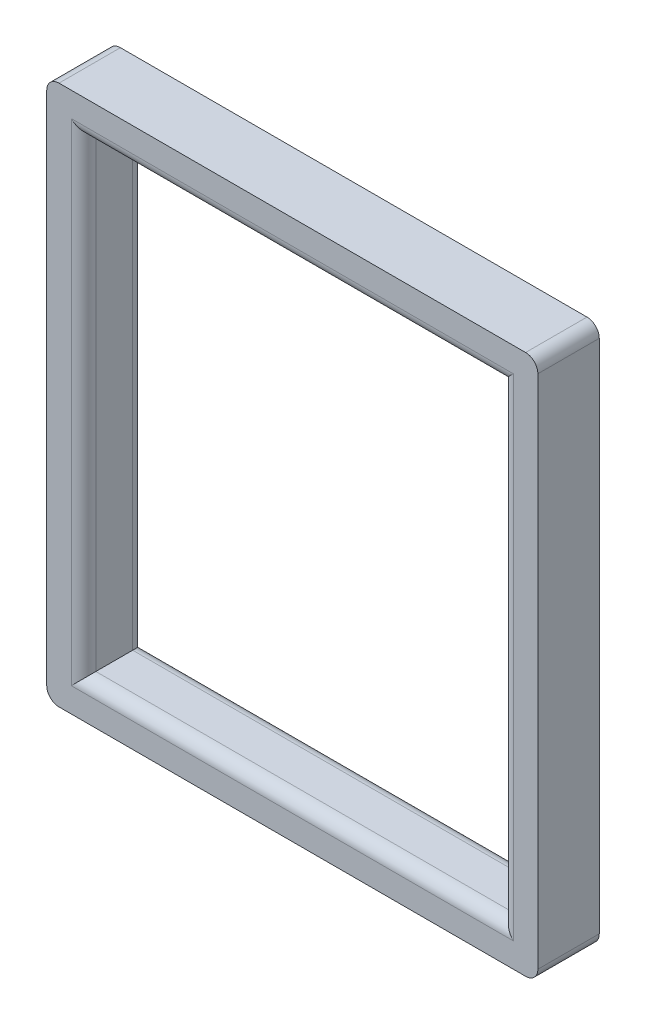
ISO-10303-21;
HEADER;
FILE_DESCRIPTION(('STEP AP214'),'2;1');
FILE_NAME('part.step','',(''),(''),'','','');
FILE_SCHEMA(('AUTOMOTIVE_DESIGN { 1 0 10303 214 1 1 1 1 }'));
ENDSEC;
DATA;
#1=APPLICATION_CONTEXT('core data for automotive mechanical design processes');
#2=APPLICATION_PROTOCOL_DEFINITION('international standard','automotive_design',2000,#1);
#3=PRODUCT_CONTEXT('',#1,'mechanical');
#4=PRODUCT('Part','Part','',(#3));
#5=PRODUCT_RELATED_PRODUCT_CATEGORY('part','',(#4));
#6=PRODUCT_DEFINITION_FORMATION('','',#4);
#7=PRODUCT_DEFINITION_CONTEXT('part definition',#1,'design');
#8=PRODUCT_DEFINITION('design','',#6,#7);
#9=PRODUCT_DEFINITION_SHAPE('','',#8);
#10=(LENGTH_UNIT() NAMED_UNIT(*) SI_UNIT(.MILLI.,.METRE.));
#11=(NAMED_UNIT(*) PLANE_ANGLE_UNIT() SI_UNIT($,.RADIAN.));
#12=(NAMED_UNIT(*) SI_UNIT($,.STERADIAN.) SOLID_ANGLE_UNIT());
#13=UNCERTAINTY_MEASURE_WITH_UNIT(LENGTH_MEASURE(1.E-05),#10,'distance_accuracy_value','');
#14=(GEOMETRIC_REPRESENTATION_CONTEXT(3) GLOBAL_UNCERTAINTY_ASSIGNED_CONTEXT((#13)) GLOBAL_UNIT_ASSIGNED_CONTEXT((#10,
#11,#12)) REPRESENTATION_CONTEXT('',''));
#15=CARTESIAN_POINT('',(0.,0.,0.));
#16=DIRECTION('',(0.,0.,1.));
#17=DIRECTION('',(1.,0.,0.));
#18=AXIS2_PLACEMENT_3D('',#15,#16,#17);
#19=CARTESIAN_POINT('',(0.,0.,3.175));
#20=DIRECTION('',(0.,0.,-1.));
#21=DIRECTION('',(-1.,0.,0.));
#22=AXIS2_PLACEMENT_3D('',#19,#20,#21);
#23=PLANE('',#22);
#24=DIRECTION('',(0.,-1.,0.));
#25=VECTOR('',#24,1.);
#26=CARTESIAN_POINT('',(-11.43,12.065,3.175));
#27=LINE('',#26,#25);
#28=CARTESIAN_POINT('',(-11.43,-12.7,3.175));
#29=VERTEX_POINT('',#28);
#30=CARTESIAN_POINT('',(-11.43,12.7,3.175));
#31=VERTEX_POINT('',#30);
#32=EDGE_CURVE('E202',#29,#31,#27,.F.);
#33=ORIENTED_EDGE('',*,*,#32,.T.);
#34=DIRECTION('',(-1.,0.,0.));
#35=VECTOR('',#34,1.);
#36=CARTESIAN_POINT('',(10.795,12.7,3.175));
#37=LINE('',#36,#35);
#38=CARTESIAN_POINT('',(11.43,12.7,3.175));
#39=VERTEX_POINT('',#38);
#40=EDGE_CURVE('E207',#31,#39,#37,.F.);
#41=ORIENTED_EDGE('',*,*,#40,.T.);
#42=DIRECTION('',(0.,1.,0.));
#43=VECTOR('',#42,1.);
#44=CARTESIAN_POINT('',(11.43,-12.065,3.175));
#45=LINE('',#44,#43);
#46=CARTESIAN_POINT('',(11.43,-12.7,3.175));
#47=VERTEX_POINT('',#46);
#48=EDGE_CURVE('E180',#39,#47,#45,.F.);
#49=ORIENTED_EDGE('',*,*,#48,.T.);
#50=DIRECTION('',(1.,0.,0.));
#51=VECTOR('',#50,1.);
#52=CARTESIAN_POINT('',(-10.795,-12.7,3.175));
#53=LINE('',#52,#51);
#54=EDGE_CURVE('E204',#47,#29,#53,.F.);
#55=ORIENTED_EDGE('',*,*,#54,.T.);
#56=EDGE_LOOP('',(#33,#41,#49,#55));
#57=FACE_BOUND('',#56,.T.);
#58=DIRECTION('',(0.,-1.,0.));
#59=VECTOR('',#58,1.);
#60=CARTESIAN_POINT('',(-12.7,-13.97,3.175));
#61=LINE('',#60,#59);
#62=CARTESIAN_POINT('',(-12.7,13.335,3.175));
#63=VERTEX_POINT('',#62);
#64=CARTESIAN_POINT('',(-12.7,-13.335,3.175));
#65=VERTEX_POINT('',#64);
#66=EDGE_CURVE('E308',#63,#65,#61,.T.);
#67=ORIENTED_EDGE('',*,*,#66,.T.);
#68=CARTESIAN_POINT('',(-12.065,-13.335,3.175));
#69=DIRECTION('',(0.,0.,-1.));
#70=DIRECTION('',(-1.,0.,0.));
#71=AXIS2_PLACEMENT_3D('',#68,#69,#70);
#72=CIRCLE('',#71,0.635);
#73=CARTESIAN_POINT('',(-12.065,-13.97,3.175));
#74=VERTEX_POINT('',#73);
#75=EDGE_CURVE('E200',#65,#74,#72,.F.);
#76=ORIENTED_EDGE('',*,*,#75,.T.);
#77=DIRECTION('',(1.,0.,0.));
#78=VECTOR('',#77,1.);
#79=CARTESIAN_POINT('',(-12.7,-13.97,3.175));
#80=LINE('',#79,#78);
#81=CARTESIAN_POINT('',(12.065,-13.97,3.175));
#82=VERTEX_POINT('',#81);
#83=EDGE_CURVE('E193',#74,#82,#80,.T.);
#84=ORIENTED_EDGE('',*,*,#83,.T.);
#85=CARTESIAN_POINT('',(12.065,-13.335,3.175));
#86=DIRECTION('',(0.,0.,-1.));
#87=DIRECTION('',(-1.,0.,0.));
#88=AXIS2_PLACEMENT_3D('',#85,#86,#87);
#89=CIRCLE('',#88,0.635);
#90=CARTESIAN_POINT('',(12.7,-13.335,3.175));
#91=VERTEX_POINT('',#90);
#92=EDGE_CURVE('E198',#82,#91,#89,.F.);
#93=ORIENTED_EDGE('',*,*,#92,.T.);
#94=DIRECTION('',(0.,1.,0.));
#95=VECTOR('',#94,1.);
#96=CARTESIAN_POINT('',(12.7,-13.97,3.175));
#97=LINE('',#96,#95);
#98=CARTESIAN_POINT('',(12.7,13.335,3.175));
#99=VERTEX_POINT('',#98);
#100=EDGE_CURVE('E294',#91,#99,#97,.T.);
#101=ORIENTED_EDGE('',*,*,#100,.T.);
#102=CARTESIAN_POINT('',(12.065,13.335,3.175));
#103=DIRECTION('',(0.,0.,-1.));
#104=DIRECTION('',(-1.,0.,0.));
#105=AXIS2_PLACEMENT_3D('',#102,#103,#104);
#106=CIRCLE('',#105,0.635);
#107=CARTESIAN_POINT('',(12.065,13.97,3.175));
#108=VERTEX_POINT('',#107);
#109=EDGE_CURVE('E191',#99,#108,#106,.F.);
#110=ORIENTED_EDGE('',*,*,#109,.T.);
#111=DIRECTION('',(-1.,0.,0.));
#112=VECTOR('',#111,1.);
#113=CARTESIAN_POINT('',(-12.7,13.97,3.175));
#114=LINE('',#113,#112);
#115=CARTESIAN_POINT('',(-12.065,13.97,3.175));
#116=VERTEX_POINT('',#115);
#117=EDGE_CURVE('E297',#108,#116,#114,.T.);
#118=ORIENTED_EDGE('',*,*,#117,.T.);
#119=CARTESIAN_POINT('',(-12.065,13.335,3.175));
#120=DIRECTION('',(0.,0.,-1.));
#121=DIRECTION('',(-1.,0.,0.));
#122=AXIS2_PLACEMENT_3D('',#119,#120,#121);
#123=CIRCLE('',#122,0.635);
#124=EDGE_CURVE('E189',#116,#63,#123,.F.);
#125=ORIENTED_EDGE('',*,*,#124,.T.);
#126=EDGE_LOOP('',(#67,#76,#84,#93,#101,#110,#118,#125));
#127=FACE_BOUND('',#126,.T.);
#128=ADVANCED_FACE('F35',(#57,#127),#23,.F.);
#129=CARTESIAN_POINT('',(0.,0.,0.));
#130=DIRECTION('',(0.,0.,-1.));
#131=DIRECTION('',(-1.,0.,0.));
#132=AXIS2_PLACEMENT_3D('',#129,#130,#131);
#133=PLANE('',#132);
#134=DIRECTION('',(0.,1.,0.));
#135=VECTOR('',#134,1.);
#136=CARTESIAN_POINT('',(11.43,0.,0.));
#137=LINE('',#136,#135);
#138=CARTESIAN_POINT('',(11.43,-12.7,0.));
#139=VERTEX_POINT('',#138);
#140=CARTESIAN_POINT('',(11.43,12.7,0.));
#141=VERTEX_POINT('',#140);
#142=EDGE_CURVE('E221',#139,#141,#137,.T.);
#143=ORIENTED_EDGE('',*,*,#142,.T.);
#144=DIRECTION('',(-1.,0.,0.));
#145=VECTOR('',#144,1.);
#146=CARTESIAN_POINT('',(0.,12.7,0.));
#147=LINE('',#146,#145);
#148=CARTESIAN_POINT('',(-11.43,12.7,0.));
#149=VERTEX_POINT('',#148);
#150=EDGE_CURVE('E163',#141,#149,#147,.T.);
#151=ORIENTED_EDGE('',*,*,#150,.T.);
#152=DIRECTION('',(0.,-1.,0.));
#153=VECTOR('',#152,1.);
#154=CARTESIAN_POINT('',(-11.43,0.,0.));
#155=LINE('',#154,#153);
#156=CARTESIAN_POINT('',(-11.43,-12.7,0.));
#157=VERTEX_POINT('',#156);
#158=EDGE_CURVE('E217',#149,#157,#155,.T.);
#159=ORIENTED_EDGE('',*,*,#158,.T.);
#160=DIRECTION('',(1.,0.,0.));
#161=VECTOR('',#160,1.);
#162=CARTESIAN_POINT('',(0.,-12.7,0.));
#163=LINE('',#162,#161);
#164=EDGE_CURVE('E219',#157,#139,#163,.T.);
#165=ORIENTED_EDGE('',*,*,#164,.T.);
#166=EDGE_LOOP('',(#143,#151,#159,#165));
#167=FACE_BOUND('',#166,.T.);
#168=DIRECTION('',(1.,0.,0.));
#169=VECTOR('',#168,1.);
#170=CARTESIAN_POINT('',(-12.7,-13.97,0.));
#171=LINE('',#170,#169);
#172=CARTESIAN_POINT('',(-12.065,-13.97,0.));
#173=VERTEX_POINT('',#172);
#174=CARTESIAN_POINT('',(12.065,-13.97,0.));
#175=VERTEX_POINT('',#174);
#176=EDGE_CURVE('E288',#173,#175,#171,.T.);
#177=ORIENTED_EDGE('',*,*,#176,.F.);
#178=CARTESIAN_POINT('',(-12.065,-13.335,0.));
#179=DIRECTION('',(0.,0.,-1.));
#180=DIRECTION('',(-1.,0.,0.));
#181=AXIS2_PLACEMENT_3D('',#178,#179,#180);
#182=CIRCLE('',#181,0.635);
#183=CARTESIAN_POINT('',(-12.7,-13.335,0.));
#184=VERTEX_POINT('',#183);
#185=EDGE_CURVE('E215',#173,#184,#182,.T.);
#186=ORIENTED_EDGE('',*,*,#185,.T.);
#187=DIRECTION('',(0.,-1.,0.));
#188=VECTOR('',#187,1.);
#189=CARTESIAN_POINT('',(-12.7,-13.97,0.));
#190=LINE('',#189,#188);
#191=CARTESIAN_POINT('',(-12.7,13.335,0.));
#192=VERTEX_POINT('',#191);
#193=EDGE_CURVE('E295',#192,#184,#190,.T.);
#194=ORIENTED_EDGE('',*,*,#193,.F.);
#195=CARTESIAN_POINT('',(-12.065,13.335,0.));
#196=DIRECTION('',(0.,0.,-1.));
#197=DIRECTION('',(-1.,0.,0.));
#198=AXIS2_PLACEMENT_3D('',#195,#196,#197);
#199=CIRCLE('',#198,0.635);
#200=CARTESIAN_POINT('',(-12.065,13.97,0.));
#201=VERTEX_POINT('',#200);
#202=EDGE_CURVE('E209',#192,#201,#199,.T.);
#203=ORIENTED_EDGE('',*,*,#202,.T.);
#204=DIRECTION('',(-1.,0.,0.));
#205=VECTOR('',#204,1.);
#206=CARTESIAN_POINT('',(-12.7,13.97,0.));
#207=LINE('',#206,#205);
#208=CARTESIAN_POINT('',(12.065,13.97,0.));
#209=VERTEX_POINT('',#208);
#210=EDGE_CURVE('E299',#209,#201,#207,.T.);
#211=ORIENTED_EDGE('',*,*,#210,.F.);
#212=CARTESIAN_POINT('',(12.065,13.335,0.));
#213=DIRECTION('',(0.,0.,-1.));
#214=DIRECTION('',(-1.,0.,0.));
#215=AXIS2_PLACEMENT_3D('',#212,#213,#214);
#216=CIRCLE('',#215,0.635);
#217=CARTESIAN_POINT('',(12.7,13.335,0.));
#218=VERTEX_POINT('',#217);
#219=EDGE_CURVE('E211',#209,#218,#216,.T.);
#220=ORIENTED_EDGE('',*,*,#219,.T.);
#221=DIRECTION('',(0.,1.,0.));
#222=VECTOR('',#221,1.);
#223=CARTESIAN_POINT('',(12.7,-13.97,0.));
#224=LINE('',#223,#222);
#225=CARTESIAN_POINT('',(12.7,-13.335,0.));
#226=VERTEX_POINT('',#225);
#227=EDGE_CURVE('E174',#226,#218,#224,.T.);
#228=ORIENTED_EDGE('',*,*,#227,.F.);
#229=CARTESIAN_POINT('',(12.065,-13.335,0.));
#230=DIRECTION('',(0.,0.,-1.));
#231=DIRECTION('',(-1.,0.,0.));
#232=AXIS2_PLACEMENT_3D('',#229,#230,#231);
#233=CIRCLE('',#232,0.635);
#234=EDGE_CURVE('E213',#226,#175,#233,.T.);
#235=ORIENTED_EDGE('',*,*,#234,.T.);
#236=EDGE_LOOP('',(#177,#186,#194,#203,#211,#220,#228,#235));
#237=FACE_BOUND('',#236,.T.);
#238=ADVANCED_FACE('F281',(#167,#237),#133,.T.);
#239=CARTESIAN_POINT('',(12.7,-13.97,3.175));
#240=DIRECTION('',(-1.,0.,0.));
#241=DIRECTION('',(0.,0.,1.));
#242=AXIS2_PLACEMENT_3D('',#239,#240,#241);
#243=PLANE('',#242);
#244=ORIENTED_EDGE('',*,*,#100,.F.);
#245=DIRECTION('',(0.,0.,-1.));
#246=VECTOR('',#245,1.);
#247=CARTESIAN_POINT('',(12.7,-13.335,3.175));
#248=LINE('',#247,#246);
#249=EDGE_CURVE('E244',#91,#226,#248,.T.);
#250=ORIENTED_EDGE('',*,*,#249,.T.);
#251=ORIENTED_EDGE('',*,*,#227,.T.);
#252=DIRECTION('',(0.,0.,-1.));
#253=VECTOR('',#252,1.);
#254=CARTESIAN_POINT('',(12.7,13.335,3.175));
#255=LINE('',#254,#253);
#256=EDGE_CURVE('E242',#218,#99,#255,.F.);
#257=ORIENTED_EDGE('',*,*,#256,.T.);
#258=EDGE_LOOP('',(#244,#250,#251,#257));
#259=FACE_BOUND('',#258,.T.);
#260=ADVANCED_FACE('F284',(#259),#243,.F.);
#261=CARTESIAN_POINT('',(-12.7,13.97,3.175));
#262=DIRECTION('',(0.,-1.,0.));
#263=DIRECTION('',(0.,0.,-1.));
#264=AXIS2_PLACEMENT_3D('',#261,#262,#263);
#265=PLANE('',#264);
#266=ORIENTED_EDGE('',*,*,#117,.F.);
#267=DIRECTION('',(0.,0.,-1.));
#268=VECTOR('',#267,1.);
#269=CARTESIAN_POINT('',(12.065,13.97,3.175));
#270=LINE('',#269,#268);
#271=EDGE_CURVE('E11',#108,#209,#270,.T.);
#272=ORIENTED_EDGE('',*,*,#271,.T.);
#273=ORIENTED_EDGE('',*,*,#210,.T.);
#274=DIRECTION('',(0.,0.,-1.));
#275=VECTOR('',#274,1.);
#276=CARTESIAN_POINT('',(-12.065,13.97,3.175));
#277=LINE('',#276,#275);
#278=EDGE_CURVE('E44',#201,#116,#277,.F.);
#279=ORIENTED_EDGE('',*,*,#278,.T.);
#280=EDGE_LOOP('',(#266,#272,#273,#279));
#281=FACE_BOUND('',#280,.T.);
#282=ADVANCED_FACE('F352',(#281),#265,.F.);
#283=CARTESIAN_POINT('',(-12.7,-13.97,3.175));
#284=DIRECTION('',(1.,0.,0.));
#285=DIRECTION('',(0.,0.,-1.));
#286=AXIS2_PLACEMENT_3D('',#283,#284,#285);
#287=PLANE('',#286);
#288=ORIENTED_EDGE('',*,*,#193,.T.);
#289=DIRECTION('',(0.,0.,-1.));
#290=VECTOR('',#289,1.);
#291=CARTESIAN_POINT('',(-12.7,-13.335,3.175));
#292=LINE('',#291,#290);
#293=EDGE_CURVE('E240',#184,#65,#292,.F.);
#294=ORIENTED_EDGE('',*,*,#293,.T.);
#295=ORIENTED_EDGE('',*,*,#66,.F.);
#296=DIRECTION('',(0.,0.,-1.));
#297=VECTOR('',#296,1.);
#298=CARTESIAN_POINT('',(-12.7,13.335,3.175));
#299=LINE('',#298,#297);
#300=EDGE_CURVE('E237',#63,#192,#299,.T.);
#301=ORIENTED_EDGE('',*,*,#300,.T.);
#302=EDGE_LOOP('',(#288,#294,#295,#301));
#303=FACE_BOUND('',#302,.T.);
#304=ADVANCED_FACE('F355',(#303),#287,.F.);
#305=CARTESIAN_POINT('',(-12.7,-13.97,3.175));
#306=DIRECTION('',(0.,1.,0.));
#307=DIRECTION('',(0.,0.,1.));
#308=AXIS2_PLACEMENT_3D('',#305,#306,#307);
#309=PLANE('',#308);
#310=ORIENTED_EDGE('',*,*,#83,.F.);
#311=DIRECTION('',(0.,0.,-1.));
#312=VECTOR('',#311,1.);
#313=CARTESIAN_POINT('',(-12.065,-13.97,3.175));
#314=LINE('',#313,#312);
#315=EDGE_CURVE('E234',#74,#173,#314,.T.);
#316=ORIENTED_EDGE('',*,*,#315,.T.);
#317=ORIENTED_EDGE('',*,*,#176,.T.);
#318=DIRECTION('',(0.,0.,-1.));
#319=VECTOR('',#318,1.);
#320=CARTESIAN_POINT('',(12.065,-13.97,3.175));
#321=LINE('',#320,#319);
#322=EDGE_CURVE('E232',#175,#82,#321,.F.);
#323=ORIENTED_EDGE('',*,*,#322,.T.);
#324=EDGE_LOOP('',(#310,#316,#317,#323));
#325=FACE_BOUND('',#324,.T.);
#326=ADVANCED_FACE('F337',(#325),#309,.F.);
#327=CARTESIAN_POINT('',(10.795,-12.065,3.175));
#328=DIRECTION('',(-1.,0.,0.));
#329=DIRECTION('',(0.,0.,1.));
#330=AXIS2_PLACEMENT_3D('',#327,#328,#329);
#331=PLANE('',#330);
#332=DIRECTION('',(0.,0.,-1.));
#333=VECTOR('',#332,1.);
#334=CARTESIAN_POINT('',(10.795,12.065,3.175));
#335=LINE('',#334,#333);
#336=CARTESIAN_POINT('',(10.795,12.065,2.54));
#337=VERTEX_POINT('',#336);
#338=CARTESIAN_POINT('',(10.795,12.065,0.635));
#339=VERTEX_POINT('',#338);
#340=EDGE_CURVE('E156',#337,#339,#335,.T.);
#341=ORIENTED_EDGE('',*,*,#340,.T.);
#342=DIRECTION('',(0.,1.,0.));
#343=VECTOR('',#342,1.);
#344=CARTESIAN_POINT('',(10.795,-12.065,0.635));
#345=LINE('',#344,#343);
#346=CARTESIAN_POINT('',(10.795,-12.065,0.635));
#347=VERTEX_POINT('',#346);
#348=EDGE_CURVE('E162',#339,#347,#345,.F.);
#349=ORIENTED_EDGE('',*,*,#348,.T.);
#350=DIRECTION('',(0.,0.,-1.));
#351=VECTOR('',#350,1.);
#352=CARTESIAN_POINT('',(10.795,-12.065,3.175));
#353=LINE('',#352,#351);
#354=CARTESIAN_POINT('',(10.795,-12.065,2.54));
#355=VERTEX_POINT('',#354);
#356=EDGE_CURVE('E157',#355,#347,#353,.T.);
#357=ORIENTED_EDGE('',*,*,#356,.F.);
#358=DIRECTION('',(0.,1.,0.));
#359=VECTOR('',#358,1.);
#360=CARTESIAN_POINT('',(10.795,12.065,2.54));
#361=LINE('',#360,#359);
#362=EDGE_CURVE('E153',#355,#337,#361,.T.);
#363=ORIENTED_EDGE('',*,*,#362,.T.);
#364=EDGE_LOOP('',(#341,#349,#357,#363));
#365=FACE_BOUND('',#364,.T.);
#366=ADVANCED_FACE('F155',(#365),#331,.T.);
#367=CARTESIAN_POINT('',(-10.795,12.065,3.175));
#368=DIRECTION('',(0.,-1.,0.));
#369=DIRECTION('',(0.,0.,-1.));
#370=AXIS2_PLACEMENT_3D('',#367,#368,#369);
#371=PLANE('',#370);
#372=ORIENTED_EDGE('',*,*,#340,.F.);
#373=DIRECTION('',(-1.,0.,0.));
#374=VECTOR('',#373,1.);
#375=CARTESIAN_POINT('',(-10.795,12.065,2.54));
#376=LINE('',#375,#374);
#377=CARTESIAN_POINT('',(-10.795,12.065,2.54));
#378=VERTEX_POINT('',#377);
#379=EDGE_CURVE('E171',#337,#378,#376,.T.);
#380=ORIENTED_EDGE('',*,*,#379,.T.);
#381=DIRECTION('',(0.,0.,-1.));
#382=VECTOR('',#381,1.);
#383=CARTESIAN_POINT('',(-10.795,12.065,3.175));
#384=LINE('',#383,#382);
#385=CARTESIAN_POINT('',(-10.795,12.065,0.635));
#386=VERTEX_POINT('',#385);
#387=EDGE_CURVE('E175',#378,#386,#384,.T.);
#388=ORIENTED_EDGE('',*,*,#387,.T.);
#389=DIRECTION('',(-1.,0.,0.));
#390=VECTOR('',#389,1.);
#391=CARTESIAN_POINT('',(-10.795,12.065,0.635));
#392=LINE('',#391,#390);
#393=EDGE_CURVE('E173',#386,#339,#392,.F.);
#394=ORIENTED_EDGE('',*,*,#393,.T.);
#395=EDGE_LOOP('',(#372,#380,#388,#394));
#396=FACE_BOUND('',#395,.T.);
#397=ADVANCED_FACE('F168',(#396),#371,.T.);
#398=CARTESIAN_POINT('',(-10.795,-12.065,3.175));
#399=DIRECTION('',(1.,0.,0.));
#400=DIRECTION('',(0.,0.,-1.));
#401=AXIS2_PLACEMENT_3D('',#398,#399,#400);
#402=PLANE('',#401);
#403=DIRECTION('',(0.,0.,-1.));
#404=VECTOR('',#403,1.);
#405=CARTESIAN_POINT('',(-10.795,-12.065,3.175));
#406=LINE('',#405,#404);
#407=CARTESIAN_POINT('',(-10.795,-12.065,2.54));
#408=VERTEX_POINT('',#407);
#409=CARTESIAN_POINT('',(-10.795,-12.065,0.635));
#410=VERTEX_POINT('',#409);
#411=EDGE_CURVE('E275',#408,#410,#406,.T.);
#412=ORIENTED_EDGE('',*,*,#411,.T.);
#413=DIRECTION('',(0.,-1.,0.));
#414=VECTOR('',#413,1.);
#415=CARTESIAN_POINT('',(-10.795,-12.065,0.635));
#416=LINE('',#415,#414);
#417=EDGE_CURVE('E230',#410,#386,#416,.F.);
#418=ORIENTED_EDGE('',*,*,#417,.T.);
#419=ORIENTED_EDGE('',*,*,#387,.F.);
#420=DIRECTION('',(0.,-1.,0.));
#421=VECTOR('',#420,1.);
#422=CARTESIAN_POINT('',(-10.795,-12.065,2.54));
#423=LINE('',#422,#421);
#424=EDGE_CURVE('E59',#378,#408,#423,.T.);
#425=ORIENTED_EDGE('',*,*,#424,.T.);
#426=EDGE_LOOP('',(#412,#418,#419,#425));
#427=FACE_BOUND('',#426,.T.);
#428=ADVANCED_FACE('F274',(#427),#402,.T.);
#429=CARTESIAN_POINT('',(-10.795,-12.065,3.175));
#430=DIRECTION('',(0.,1.,0.));
#431=DIRECTION('',(0.,0.,1.));
#432=AXIS2_PLACEMENT_3D('',#429,#430,#431);
#433=PLANE('',#432);
#434=ORIENTED_EDGE('',*,*,#411,.F.);
#435=DIRECTION('',(1.,0.,0.));
#436=VECTOR('',#435,1.);
#437=CARTESIAN_POINT('',(10.795,-12.065,2.54));
#438=LINE('',#437,#436);
#439=EDGE_CURVE('E227',#408,#355,#438,.T.);
#440=ORIENTED_EDGE('',*,*,#439,.T.);
#441=ORIENTED_EDGE('',*,*,#356,.T.);
#442=DIRECTION('',(1.,0.,0.));
#443=VECTOR('',#442,1.);
#444=CARTESIAN_POINT('',(-10.795,-12.065,0.635));
#445=LINE('',#444,#443);
#446=EDGE_CURVE('E52',#347,#410,#445,.F.);
#447=ORIENTED_EDGE('',*,*,#446,.T.);
#448=EDGE_LOOP('',(#434,#440,#441,#447));
#449=FACE_BOUND('',#448,.T.);
#450=ADVANCED_FACE('F314',(#449),#433,.T.);
#451=CARTESIAN_POINT('',(-10.795,-12.7,2.54));
#452=DIRECTION('',(-1.,0.,0.));
#453=DIRECTION('',(0.,0.,1.));
#454=AXIS2_PLACEMENT_3D('',#451,#452,#453);
#455=CYLINDRICAL_SURFACE('',#454,0.635);
#456=CARTESIAN_POINT('',(-11.43,-12.7,2.54));
#457=DIRECTION('',(-0.707106781186547,0.707106781186547,0.));
#458=DIRECTION('',(-0.707106781186547,-0.707106781186547,0.));
#459=AXIS2_PLACEMENT_3D('',#456,#457,#458);
#460=ELLIPSE('',#459,0.898025612106915,0.635);
#461=EDGE_CURVE('E184',#29,#408,#460,.T.);
#462=ORIENTED_EDGE('',*,*,#461,.F.);
#463=ORIENTED_EDGE('',*,*,#54,.F.);
#464=CARTESIAN_POINT('',(11.43,-12.7,2.54));
#465=DIRECTION('',(-0.707106781186547,-0.707106781186547,0.));
#466=DIRECTION('',(0.707106781186547,-0.707106781186547,0.));
#467=AXIS2_PLACEMENT_3D('',#464,#465,#466);
#468=ELLIPSE('',#467,0.898025612106915,0.635);
#469=EDGE_CURVE('E251',#355,#47,#468,.F.);
#470=ORIENTED_EDGE('',*,*,#469,.F.);
#471=ORIENTED_EDGE('',*,*,#439,.F.);
#472=EDGE_LOOP('',(#462,#463,#470,#471));
#473=FACE_BOUND('',#472,.T.);
#474=ADVANCED_FACE('F318',(#473),#455,.T.);
#475=CARTESIAN_POINT('',(11.43,-12.065,2.54));
#476=DIRECTION('',(0.,-1.,0.));
#477=DIRECTION('',(0.,0.,-1.));
#478=AXIS2_PLACEMENT_3D('',#475,#476,#477);
#479=CYLINDRICAL_SURFACE('',#478,0.635);
#480=ORIENTED_EDGE('',*,*,#469,.T.);
#481=ORIENTED_EDGE('',*,*,#48,.F.);
#482=CARTESIAN_POINT('',(11.43,12.7,2.54));
#483=DIRECTION('',(0.707106781186547,-0.707106781186547,0.));
#484=DIRECTION('',(0.707106781186547,0.707106781186547,0.));
#485=AXIS2_PLACEMENT_3D('',#482,#483,#484);
#486=ELLIPSE('',#485,0.898025612106915,0.635);
#487=EDGE_CURVE('E178',#337,#39,#486,.F.);
#488=ORIENTED_EDGE('',*,*,#487,.F.);
#489=ORIENTED_EDGE('',*,*,#362,.F.);
#490=EDGE_LOOP('',(#480,#481,#488,#489));
#491=FACE_BOUND('',#490,.T.);
#492=ADVANCED_FACE('F179',(#491),#479,.T.);
#493=CARTESIAN_POINT('',(-11.43,-12.065,2.54));
#494=DIRECTION('',(0.,1.,0.));
#495=DIRECTION('',(0.,0.,1.));
#496=AXIS2_PLACEMENT_3D('',#493,#494,#495);
#497=CYLINDRICAL_SURFACE('',#496,0.635);
#498=ORIENTED_EDGE('',*,*,#461,.T.);
#499=ORIENTED_EDGE('',*,*,#424,.F.);
#500=CARTESIAN_POINT('',(-11.43,12.7,2.54));
#501=DIRECTION('',(0.707106781186547,0.707106781186547,0.));
#502=DIRECTION('',(0.707106781186547,-0.707106781186547,0.));
#503=AXIS2_PLACEMENT_3D('',#500,#501,#502);
#504=ELLIPSE('',#503,0.898025612106915,0.635);
#505=EDGE_CURVE('E185',#31,#378,#504,.T.);
#506=ORIENTED_EDGE('',*,*,#505,.F.);
#507=ORIENTED_EDGE('',*,*,#32,.F.);
#508=EDGE_LOOP('',(#498,#499,#506,#507));
#509=FACE_BOUND('',#508,.T.);
#510=ADVANCED_FACE('F322',(#509),#497,.T.);
#511=CARTESIAN_POINT('',(-10.795,12.7,2.54));
#512=DIRECTION('',(1.,0.,0.));
#513=DIRECTION('',(0.,0.,-1.));
#514=AXIS2_PLACEMENT_3D('',#511,#512,#513);
#515=CYLINDRICAL_SURFACE('',#514,0.635);
#516=ORIENTED_EDGE('',*,*,#487,.T.);
#517=ORIENTED_EDGE('',*,*,#40,.F.);
#518=ORIENTED_EDGE('',*,*,#505,.T.);
#519=ORIENTED_EDGE('',*,*,#379,.F.);
#520=EDGE_LOOP('',(#516,#517,#518,#519));
#521=FACE_BOUND('',#520,.T.);
#522=ADVANCED_FACE('F187',(#521),#515,.T.);
#523=CARTESIAN_POINT('',(0.,-12.7,0.635));
#524=DIRECTION('',(1.,0.,0.));
#525=DIRECTION('',(0.,0.,-1.));
#526=AXIS2_PLACEMENT_3D('',#523,#524,#525);
#527=CYLINDRICAL_SURFACE('',#526,0.635);
#528=CARTESIAN_POINT('',(-11.43,-12.7,0.635));
#529=DIRECTION('',(0.707106781186547,-0.707106781186547,0.));
#530=DIRECTION('',(0.707106781186547,0.707106781186547,0.));
#531=AXIS2_PLACEMENT_3D('',#528,#529,#530);
#532=ELLIPSE('',#531,0.898025612106915,0.635);
#533=EDGE_CURVE('E256',#410,#157,#532,.F.);
#534=ORIENTED_EDGE('',*,*,#533,.F.);
#535=ORIENTED_EDGE('',*,*,#446,.F.);
#536=CARTESIAN_POINT('',(11.43,-12.7,0.635));
#537=DIRECTION('',(0.707106781186547,0.707106781186547,0.));
#538=DIRECTION('',(-0.707106781186547,0.707106781186547,0.));
#539=AXIS2_PLACEMENT_3D('',#536,#537,#538);
#540=ELLIPSE('',#539,0.898025612106915,0.635);
#541=EDGE_CURVE('E39',#139,#347,#540,.T.);
#542=ORIENTED_EDGE('',*,*,#541,.F.);
#543=ORIENTED_EDGE('',*,*,#164,.F.);
#544=EDGE_LOOP('',(#534,#535,#542,#543));
#545=FACE_BOUND('',#544,.T.);
#546=ADVANCED_FACE('F271',(#545),#527,.T.);
#547=CARTESIAN_POINT('',(11.43,0.,0.635));
#548=DIRECTION('',(0.,1.,0.));
#549=DIRECTION('',(0.,0.,1.));
#550=AXIS2_PLACEMENT_3D('',#547,#548,#549);
#551=CYLINDRICAL_SURFACE('',#550,0.635);
#552=ORIENTED_EDGE('',*,*,#541,.T.);
#553=ORIENTED_EDGE('',*,*,#348,.F.);
#554=CARTESIAN_POINT('',(11.43,12.7,0.635));
#555=DIRECTION('',(-0.707106781186547,0.707106781186547,0.));
#556=DIRECTION('',(-0.707106781186547,-0.707106781186547,0.));
#557=AXIS2_PLACEMENT_3D('',#554,#555,#556);
#558=ELLIPSE('',#557,0.898025612106915,0.635);
#559=EDGE_CURVE('E255',#141,#339,#558,.T.);
#560=ORIENTED_EDGE('',*,*,#559,.F.);
#561=ORIENTED_EDGE('',*,*,#142,.F.);
#562=EDGE_LOOP('',(#552,#553,#560,#561));
#563=FACE_BOUND('',#562,.T.);
#564=ADVANCED_FACE('F267',(#563),#551,.T.);
#565=CARTESIAN_POINT('',(-11.43,0.,0.635));
#566=DIRECTION('',(0.,-1.,0.));
#567=DIRECTION('',(0.,0.,-1.));
#568=AXIS2_PLACEMENT_3D('',#565,#566,#567);
#569=CYLINDRICAL_SURFACE('',#568,0.635);
#570=ORIENTED_EDGE('',*,*,#533,.T.);
#571=ORIENTED_EDGE('',*,*,#158,.F.);
#572=CARTESIAN_POINT('',(-11.43,12.7,0.635));
#573=DIRECTION('',(-0.707106781186547,-0.707106781186547,0.));
#574=DIRECTION('',(-0.707106781186547,0.707106781186547,0.));
#575=AXIS2_PLACEMENT_3D('',#572,#573,#574);
#576=ELLIPSE('',#575,0.898025612106915,0.635);
#577=EDGE_CURVE('E253',#386,#149,#576,.F.);
#578=ORIENTED_EDGE('',*,*,#577,.F.);
#579=ORIENTED_EDGE('',*,*,#417,.F.);
#580=EDGE_LOOP('',(#570,#571,#578,#579));
#581=FACE_BOUND('',#580,.T.);
#582=ADVANCED_FACE('F273',(#581),#569,.T.);
#583=CARTESIAN_POINT('',(0.,12.7,0.635));
#584=DIRECTION('',(-1.,0.,0.));
#585=DIRECTION('',(0.,0.,1.));
#586=AXIS2_PLACEMENT_3D('',#583,#584,#585);
#587=CYLINDRICAL_SURFACE('',#586,0.635);
#588=ORIENTED_EDGE('',*,*,#559,.T.);
#589=ORIENTED_EDGE('',*,*,#393,.F.);
#590=ORIENTED_EDGE('',*,*,#577,.T.);
#591=ORIENTED_EDGE('',*,*,#150,.F.);
#592=EDGE_LOOP('',(#588,#589,#590,#591));
#593=FACE_BOUND('',#592,.T.);
#594=ADVANCED_FACE('F278',(#593),#587,.T.);
#595=CARTESIAN_POINT('',(-12.065,-13.335,3.175));
#596=DIRECTION('',(0.,0.,-1.));
#597=DIRECTION('',(-1.,0.,0.));
#598=AXIS2_PLACEMENT_3D('',#595,#596,#597);
#599=CYLINDRICAL_SURFACE('',#598,0.635);
#600=ORIENTED_EDGE('',*,*,#75,.F.);
#601=ORIENTED_EDGE('',*,*,#293,.F.);
#602=ORIENTED_EDGE('',*,*,#185,.F.);
#603=ORIENTED_EDGE('',*,*,#315,.F.);
#604=EDGE_LOOP('',(#600,#601,#602,#603));
#605=FACE_BOUND('',#604,.T.);
#606=ADVANCED_FACE('F336',(#605),#599,.T.);
#607=CARTESIAN_POINT('',(12.065,-13.335,3.175));
#608=DIRECTION('',(0.,0.,-1.));
#609=DIRECTION('',(-1.,0.,0.));
#610=AXIS2_PLACEMENT_3D('',#607,#608,#609);
#611=CYLINDRICAL_SURFACE('',#610,0.635);
#612=ORIENTED_EDGE('',*,*,#92,.F.);
#613=ORIENTED_EDGE('',*,*,#322,.F.);
#614=ORIENTED_EDGE('',*,*,#234,.F.);
#615=ORIENTED_EDGE('',*,*,#249,.F.);
#616=EDGE_LOOP('',(#612,#613,#614,#615));
#617=FACE_BOUND('',#616,.T.);
#618=ADVANCED_FACE('F342',(#617),#611,.T.);
#619=CARTESIAN_POINT('',(12.065,13.335,3.175));
#620=DIRECTION('',(0.,0.,-1.));
#621=DIRECTION('',(-1.,0.,0.));
#622=AXIS2_PLACEMENT_3D('',#619,#620,#621);
#623=CYLINDRICAL_SURFACE('',#622,0.635);
#624=ORIENTED_EDGE('',*,*,#109,.F.);
#625=ORIENTED_EDGE('',*,*,#256,.F.);
#626=ORIENTED_EDGE('',*,*,#219,.F.);
#627=ORIENTED_EDGE('',*,*,#271,.F.);
#628=EDGE_LOOP('',(#624,#625,#626,#627));
#629=FACE_BOUND('',#628,.T.);
#630=ADVANCED_FACE('F349',(#629),#623,.T.);
#631=CARTESIAN_POINT('',(-12.065,13.335,3.175));
#632=DIRECTION('',(0.,0.,-1.));
#633=DIRECTION('',(-1.,0.,0.));
#634=AXIS2_PLACEMENT_3D('',#631,#632,#633);
#635=CYLINDRICAL_SURFACE('',#634,0.635);
#636=ORIENTED_EDGE('',*,*,#124,.F.);
#637=ORIENTED_EDGE('',*,*,#278,.F.);
#638=ORIENTED_EDGE('',*,*,#202,.F.);
#639=ORIENTED_EDGE('',*,*,#300,.F.);
#640=EDGE_LOOP('',(#636,#637,#638,#639));
#641=FACE_BOUND('',#640,.T.);
#642=ADVANCED_FACE('F37',(#641),#635,.T.);
#643=CLOSED_SHELL('',(#128,#238,#260,#282,#304,#326,#366,#397,#428,#450,#474,#492,#510,#522,
#546,#564,#582,#594,#606,#618,#630,#642));
#644=MANIFOLD_SOLID_BREP('B2',#643);
#645=ADVANCED_BREP_SHAPE_REPRESENTATION('',(#18,#644),#14);
#646=SHAPE_DEFINITION_REPRESENTATION(#9,#645);
ENDSEC;
END-ISO-10303-21;
